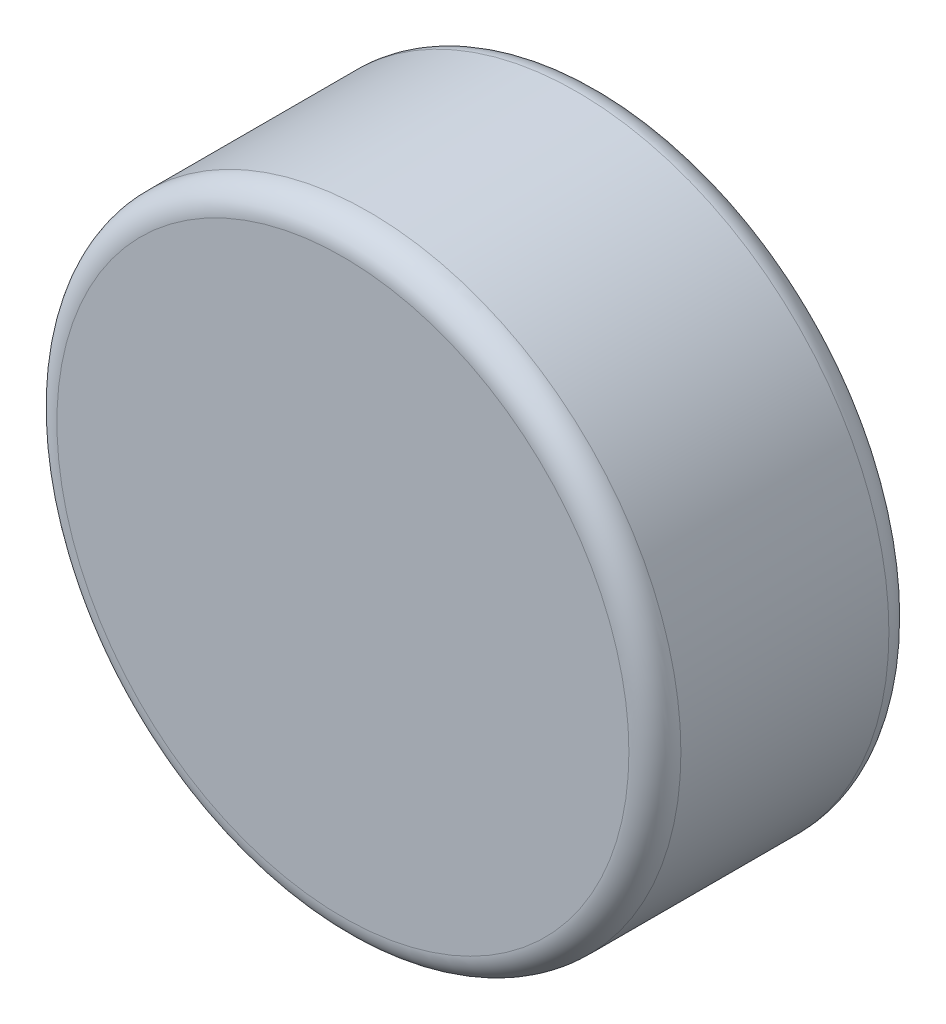
ISO-10303-21;
HEADER;
FILE_DESCRIPTION(('STEP AP214'),'2;1');
FILE_NAME('part.step','',(''),(''),'','','');
FILE_SCHEMA(('AUTOMOTIVE_DESIGN { 1 0 10303 214 1 1 1 1 }'));
ENDSEC;
DATA;
#1=APPLICATION_CONTEXT('core data for automotive mechanical design processes');
#2=APPLICATION_PROTOCOL_DEFINITION('international standard','automotive_design',2000,#1);
#3=PRODUCT_CONTEXT('',#1,'mechanical');
#4=PRODUCT('Part','Part','',(#3));
#5=PRODUCT_RELATED_PRODUCT_CATEGORY('part','',(#4));
#6=PRODUCT_DEFINITION_FORMATION('','',#4);
#7=PRODUCT_DEFINITION_CONTEXT('part definition',#1,'design');
#8=PRODUCT_DEFINITION('design','',#6,#7);
#9=PRODUCT_DEFINITION_SHAPE('','',#8);
#10=(LENGTH_UNIT() NAMED_UNIT(*) SI_UNIT(.MILLI.,.METRE.));
#11=(NAMED_UNIT(*) PLANE_ANGLE_UNIT() SI_UNIT($,.RADIAN.));
#12=(NAMED_UNIT(*) SI_UNIT($,.STERADIAN.) SOLID_ANGLE_UNIT());
#13=UNCERTAINTY_MEASURE_WITH_UNIT(LENGTH_MEASURE(1.E-05),#10,'distance_accuracy_value','');
#14=(GEOMETRIC_REPRESENTATION_CONTEXT(3) GLOBAL_UNCERTAINTY_ASSIGNED_CONTEXT((#13)) GLOBAL_UNIT_ASSIGNED_CONTEXT((#10,
#11,#12)) REPRESENTATION_CONTEXT('',''));
#15=CARTESIAN_POINT('',(0.,0.,0.));
#16=DIRECTION('',(0.,0.,1.));
#17=DIRECTION('',(1.,0.,0.));
#18=AXIS2_PLACEMENT_3D('',#15,#16,#17);
#19=CARTESIAN_POINT('',(0.,0.,1.25));
#20=DIRECTION('',(0.,0.,-1.));
#21=DIRECTION('',(-1.,0.,0.));
#22=AXIS2_PLACEMENT_3D('',#19,#20,#21);
#23=CYLINDRICAL_SURFACE('',#22,3.);
#24=CARTESIAN_POINT('',(0.,0.,1.));
#25=DIRECTION('',(0.,0.,1.));
#26=DIRECTION('',(1.,0.,0.));
#27=AXIS2_PLACEMENT_3D('',#24,#25,#26);
#28=CIRCLE('',#27,3.);
#29=CARTESIAN_POINT('',(3.,0.,1.));
#30=VERTEX_POINT('',#29);
#31=EDGE_CURVE('E40',#30,#30,#28,.F.);
#32=ORIENTED_EDGE('',*,*,#31,.T.);
#33=EDGE_LOOP('',(#32));
#34=FACE_BOUND('',#33,.T.);
#35=CARTESIAN_POINT('',(0.,0.,-1.));
#36=DIRECTION('',(0.,0.,1.));
#37=DIRECTION('',(1.,0.,0.));
#38=AXIS2_PLACEMENT_3D('',#35,#36,#37);
#39=CIRCLE('',#38,3.);
#40=CARTESIAN_POINT('',(3.,0.,-1.));
#41=VERTEX_POINT('',#40);
#42=EDGE_CURVE('E44',#41,#41,#39,.T.);
#43=ORIENTED_EDGE('',*,*,#42,.T.);
#44=EDGE_LOOP('',(#43));
#45=FACE_BOUND('',#44,.T.);
#46=ADVANCED_FACE('F33',(#34,#45),#23,.T.);
#47=CARTESIAN_POINT('',(0.,0.,1.25));
#48=DIRECTION('',(0.,0.,1.));
#49=DIRECTION('',(1.,0.,0.));
#50=AXIS2_PLACEMENT_3D('',#47,#48,#49);
#51=PLANE('',#50);
#52=CARTESIAN_POINT('',(0.,0.,1.25));
#53=DIRECTION('',(0.,0.,1.));
#54=DIRECTION('',(1.,0.,0.));
#55=AXIS2_PLACEMENT_3D('',#52,#53,#54);
#56=CIRCLE('',#55,2.75);
#57=CARTESIAN_POINT('',(2.75,0.,1.25));
#58=VERTEX_POINT('',#57);
#59=EDGE_CURVE('E48',#58,#58,#56,.T.);
#60=ORIENTED_EDGE('',*,*,#59,.T.);
#61=EDGE_LOOP('',(#60));
#62=FACE_BOUND('',#61,.T.);
#63=ADVANCED_FACE('F54',(#62),#51,.T.);
#64=CARTESIAN_POINT('',(0.,0.,-1.25));
#65=DIRECTION('',(0.,0.,1.));
#66=DIRECTION('',(1.,0.,0.));
#67=AXIS2_PLACEMENT_3D('',#64,#65,#66);
#68=PLANE('',#67);
#69=CARTESIAN_POINT('',(0.,0.,-1.25));
#70=DIRECTION('',(0.,0.,1.));
#71=DIRECTION('',(1.,0.,0.));
#72=AXIS2_PLACEMENT_3D('',#69,#70,#71);
#73=CIRCLE('',#72,2.75);
#74=CARTESIAN_POINT('',(2.75,0.,-1.25));
#75=VERTEX_POINT('',#74);
#76=EDGE_CURVE('E10',#75,#75,#73,.F.);
#77=ORIENTED_EDGE('',*,*,#76,.T.);
#78=EDGE_LOOP('',(#77));
#79=FACE_BOUND('',#78,.T.);
#80=ADVANCED_FACE('F58',(#79),#68,.F.);
#81=CARTESIAN_POINT('',(0.,0.,1.));
#82=DIRECTION('',(0.,0.,1.));
#83=DIRECTION('',(1.,0.,0.));
#84=AXIS2_PLACEMENT_3D('',#81,#82,#83);
#85=TOROIDAL_SURFACE('',#84,2.75,0.25);
#86=ORIENTED_EDGE('',*,*,#31,.F.);
#87=EDGE_LOOP('',(#86));
#88=FACE_BOUND('',#87,.T.);
#89=ORIENTED_EDGE('',*,*,#59,.F.);
#90=EDGE_LOOP('',(#89));
#91=FACE_BOUND('',#90,.T.);
#92=ADVANCED_FACE('F56',(#88,#91),#85,.T.);
#93=CARTESIAN_POINT('',(0.,0.,-1.));
#94=DIRECTION('',(0.,0.,1.));
#95=DIRECTION('',(1.,0.,0.));
#96=AXIS2_PLACEMENT_3D('',#93,#94,#95);
#97=TOROIDAL_SURFACE('',#96,2.75,0.25);
#98=ORIENTED_EDGE('',*,*,#76,.F.);
#99=EDGE_LOOP('',(#98));
#100=FACE_BOUND('',#99,.T.);
#101=ORIENTED_EDGE('',*,*,#42,.F.);
#102=EDGE_LOOP('',(#101));
#103=FACE_BOUND('',#102,.T.);
#104=ADVANCED_FACE('F35',(#100,#103),#97,.T.);
#105=CLOSED_SHELL('',(#46,#63,#80,#92,#104));
#106=MANIFOLD_SOLID_BREP('B2',#105);
#107=ADVANCED_BREP_SHAPE_REPRESENTATION('',(#18,#106),#14);
#108=SHAPE_DEFINITION_REPRESENTATION(#9,#107);
ENDSEC;
END-ISO-10303-21;
